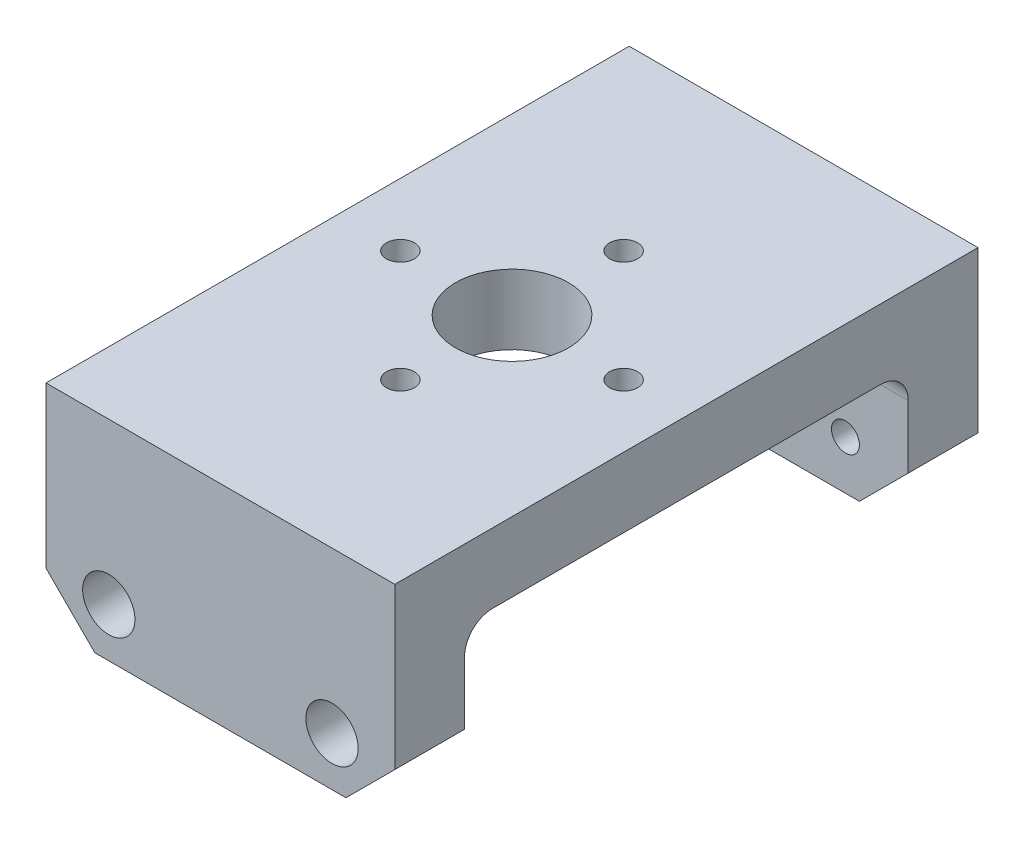
ISO-10303-21;
HEADER;
FILE_DESCRIPTION(('STEP AP214'),'2;1');
FILE_NAME('part.step','',(''),(''),'','','');
FILE_SCHEMA(('AUTOMOTIVE_DESIGN { 1 0 10303 214 1 1 1 1 }'));
ENDSEC;
DATA;
#1=APPLICATION_CONTEXT('core data for automotive mechanical design processes');
#2=APPLICATION_PROTOCOL_DEFINITION('international standard','automotive_design',2000,#1);
#3=PRODUCT_CONTEXT('',#1,'mechanical');
#4=PRODUCT('Part','Part','',(#3));
#5=PRODUCT_RELATED_PRODUCT_CATEGORY('part','',(#4));
#6=PRODUCT_DEFINITION_FORMATION('','',#4);
#7=PRODUCT_DEFINITION_CONTEXT('part definition',#1,'design');
#8=PRODUCT_DEFINITION('design','',#6,#7);
#9=PRODUCT_DEFINITION_SHAPE('','',#8);
#10=(LENGTH_UNIT() NAMED_UNIT(*) SI_UNIT(.MILLI.,.METRE.));
#11=(NAMED_UNIT(*) PLANE_ANGLE_UNIT() SI_UNIT($,.RADIAN.));
#12=(NAMED_UNIT(*) SI_UNIT($,.STERADIAN.) SOLID_ANGLE_UNIT());
#13=UNCERTAINTY_MEASURE_WITH_UNIT(LENGTH_MEASURE(1.E-05),#10,'distance_accuracy_value','');
#14=(GEOMETRIC_REPRESENTATION_CONTEXT(3) GLOBAL_UNCERTAINTY_ASSIGNED_CONTEXT((#13)) GLOBAL_UNIT_ASSIGNED_CONTEXT((#10,
#11,#12)) REPRESENTATION_CONTEXT('',''));
#15=CARTESIAN_POINT('',(0.,0.,0.));
#16=DIRECTION('',(0.,0.,1.));
#17=DIRECTION('',(1.,0.,0.));
#18=AXIS2_PLACEMENT_3D('',#15,#16,#17);
#19=CARTESIAN_POINT('',(12.5000000000024,15.,28.9));
#20=DIRECTION('',(0.,-1.,0.));
#21=DIRECTION('',(0.,0.,-1.));
#22=AXIS2_PLACEMENT_3D('',#19,#20,#21);
#23=CYLINDRICAL_SURFACE('',#22,1.);
#24=CARTESIAN_POINT('',(12.5000000000024,15.,28.9));
#25=DIRECTION('',(0.,-1.,0.));
#26=DIRECTION('',(1.,0.,0.));
#27=AXIS2_PLACEMENT_3D('',#24,#25,#26);
#28=CIRCLE('',#27,1.);
#29=CARTESIAN_POINT('',(13.5000000000024,15.,28.9));
#30=VERTEX_POINT('',#29);
#31=EDGE_CURVE('E762',#30,#30,#28,.T.);
#32=ORIENTED_EDGE('',*,*,#31,.F.);
#33=EDGE_LOOP('',(#32));
#34=FACE_BOUND('',#33,.T.);
#35=CARTESIAN_POINT('',(12.5000000000024,11.25,28.9));
#36=DIRECTION('',(0.,-1.,0.));
#37=DIRECTION('',(0.,0.,-1.));
#38=AXIS2_PLACEMENT_3D('',#35,#36,#37);
#39=CIRCLE('',#38,1.);
#40=CARTESIAN_POINT('',(12.5000000000024,11.25,27.9));
#41=VERTEX_POINT('',#40);
#42=EDGE_CURVE('E745',#41,#41,#39,.F.);
#43=ORIENTED_EDGE('',*,*,#42,.F.);
#44=EDGE_LOOP('',(#43));
#45=FACE_BOUND('',#44,.T.);
#46=ADVANCED_FACE('F34',(#34,#45),#23,.F.);
#47=CARTESIAN_POINT('',(4.5,15.,20.9000000000023));
#48=DIRECTION('',(0.,-1.,0.));
#49=DIRECTION('',(0.,0.,-1.));
#50=AXIS2_PLACEMENT_3D('',#47,#48,#49);
#51=CYLINDRICAL_SURFACE('',#50,1.);
#52=CARTESIAN_POINT('',(4.5,15.,20.9000000000023));
#53=DIRECTION('',(0.,-1.,0.));
#54=DIRECTION('',(0.,0.,1.));
#55=AXIS2_PLACEMENT_3D('',#52,#53,#54);
#56=CIRCLE('',#55,1.);
#57=CARTESIAN_POINT('',(4.5,15.,21.9000000000023));
#58=VERTEX_POINT('',#57);
#59=EDGE_CURVE('E765',#58,#58,#56,.T.);
#60=ORIENTED_EDGE('',*,*,#59,.F.);
#61=EDGE_LOOP('',(#60));
#62=FACE_BOUND('',#61,.T.);
#63=CARTESIAN_POINT('',(4.5,11.25,20.9000000000023));
#64=DIRECTION('',(0.,-1.,0.));
#65=DIRECTION('',(0.,0.,-1.));
#66=AXIS2_PLACEMENT_3D('',#63,#64,#65);
#67=CIRCLE('',#66,1.);
#68=CARTESIAN_POINT('',(4.5,11.25,19.9000000000023));
#69=VERTEX_POINT('',#68);
#70=EDGE_CURVE('E751',#69,#69,#67,.F.);
#71=ORIENTED_EDGE('',*,*,#70,.F.);
#72=EDGE_LOOP('',(#71));
#73=FACE_BOUND('',#72,.T.);
#74=ADVANCED_FACE('F333',(#62,#73),#51,.F.);
#75=CARTESIAN_POINT('',(12.4999999999977,15.,12.9));
#76=DIRECTION('',(0.,-1.,0.));
#77=DIRECTION('',(0.,0.,-1.));
#78=AXIS2_PLACEMENT_3D('',#75,#76,#77);
#79=CYLINDRICAL_SURFACE('',#78,1.);
#80=CARTESIAN_POINT('',(12.4999999999977,15.,12.9));
#81=DIRECTION('',(0.,-1.,0.));
#82=DIRECTION('',(-1.,0.,0.));
#83=AXIS2_PLACEMENT_3D('',#80,#81,#82);
#84=CIRCLE('',#83,1.);
#85=CARTESIAN_POINT('',(11.4999999999977,15.,12.9));
#86=VERTEX_POINT('',#85);
#87=EDGE_CURVE('E768',#86,#86,#84,.T.);
#88=ORIENTED_EDGE('',*,*,#87,.F.);
#89=EDGE_LOOP('',(#88));
#90=FACE_BOUND('',#89,.T.);
#91=CARTESIAN_POINT('',(12.4999999999977,11.25,12.9));
#92=DIRECTION('',(0.,-1.,0.));
#93=DIRECTION('',(0.,0.,-1.));
#94=AXIS2_PLACEMENT_3D('',#91,#92,#93);
#95=CIRCLE('',#94,1.);
#96=CARTESIAN_POINT('',(12.4999999999977,11.25,11.9));
#97=VERTEX_POINT('',#96);
#98=EDGE_CURVE('E758',#97,#97,#95,.F.);
#99=ORIENTED_EDGE('',*,*,#98,.F.);
#100=EDGE_LOOP('',(#99));
#101=FACE_BOUND('',#100,.T.);
#102=ADVANCED_FACE('F339',(#90,#101),#79,.F.);
#103=CARTESIAN_POINT('',(20.5,15.,20.8999999999977));
#104=DIRECTION('',(0.,-1.,0.));
#105=DIRECTION('',(0.,0.,-1.));
#106=AXIS2_PLACEMENT_3D('',#103,#104,#105);
#107=CYLINDRICAL_SURFACE('',#106,1.);
#108=CARTESIAN_POINT('',(20.5,15.,20.8999999999977));
#109=DIRECTION('',(0.,-1.,0.));
#110=DIRECTION('',(0.,0.,-1.));
#111=AXIS2_PLACEMENT_3D('',#108,#109,#110);
#112=CIRCLE('',#111,1.);
#113=CARTESIAN_POINT('',(20.5,15.,19.8999999999977));
#114=VERTEX_POINT('',#113);
#115=EDGE_CURVE('E778',#114,#114,#112,.T.);
#116=ORIENTED_EDGE('',*,*,#115,.F.);
#117=EDGE_LOOP('',(#116));
#118=FACE_BOUND('',#117,.T.);
#119=CARTESIAN_POINT('',(20.5,11.25,20.8999999999977));
#120=DIRECTION('',(0.,-1.,0.));
#121=DIRECTION('',(0.,0.,-1.));
#122=AXIS2_PLACEMENT_3D('',#119,#120,#121);
#123=CIRCLE('',#122,1.);
#124=CARTESIAN_POINT('',(20.5,11.25,19.8999999999977));
#125=VERTEX_POINT('',#124);
#126=EDGE_CURVE('E775',#125,#125,#123,.F.);
#127=ORIENTED_EDGE('',*,*,#126,.F.);
#128=EDGE_LOOP('',(#127));
#129=FACE_BOUND('',#128,.T.);
#130=ADVANCED_FACE('F350',(#118,#129),#107,.F.);
#131=CARTESIAN_POINT('',(4.5,3.5,5.));
#132=DIRECTION('',(0.,0.,-1.));
#133=DIRECTION('',(-1.,0.,0.));
#134=AXIS2_PLACEMENT_3D('',#131,#132,#133);
#135=CYLINDRICAL_SURFACE('',#134,1.);
#136=CARTESIAN_POINT('',(4.5,3.5,5.));
#137=DIRECTION('',(0.,0.,1.));
#138=DIRECTION('',(1.,0.,0.));
#139=AXIS2_PLACEMENT_3D('',#136,#137,#138);
#140=CIRCLE('',#139,1.);
#141=CARTESIAN_POINT('',(5.5,3.5,5.));
#142=VERTEX_POINT('',#141);
#143=EDGE_CURVE('E229',#142,#142,#140,.T.);
#144=ORIENTED_EDGE('',*,*,#143,.T.);
#145=EDGE_LOOP('',(#144));
#146=FACE_BOUND('',#145,.T.);
#147=CARTESIAN_POINT('',(4.5,3.5,3.3));
#148=DIRECTION('',(0.,0.,-1.));
#149=DIRECTION('',(-1.,0.,0.));
#150=AXIS2_PLACEMENT_3D('',#147,#148,#149);
#151=CIRCLE('',#150,1.);
#152=CARTESIAN_POINT('',(3.5,3.5,3.3));
#153=VERTEX_POINT('',#152);
#154=EDGE_CURVE('E243',#153,#153,#151,.T.);
#155=ORIENTED_EDGE('',*,*,#154,.T.);
#156=EDGE_LOOP('',(#155));
#157=FACE_BOUND('',#156,.T.);
#158=ADVANCED_FACE('F363',(#146,#157),#135,.F.);
#159=CARTESIAN_POINT('',(20.5,3.5,5.));
#160=DIRECTION('',(0.,0.,-1.));
#161=DIRECTION('',(-1.,0.,0.));
#162=AXIS2_PLACEMENT_3D('',#159,#160,#161);
#163=CYLINDRICAL_SURFACE('',#162,1.);
#164=CARTESIAN_POINT('',(20.5,3.5,5.));
#165=DIRECTION('',(0.,0.,1.));
#166=DIRECTION('',(1.,0.,0.));
#167=AXIS2_PLACEMENT_3D('',#164,#165,#166);
#168=CIRCLE('',#167,1.);
#169=CARTESIAN_POINT('',(21.5,3.5,5.));
#170=VERTEX_POINT('',#169);
#171=EDGE_CURVE('E289',#170,#170,#168,.T.);
#172=ORIENTED_EDGE('',*,*,#171,.T.);
#173=EDGE_LOOP('',(#172));
#174=FACE_BOUND('',#173,.T.);
#175=CARTESIAN_POINT('',(20.5,3.5,3.3));
#176=DIRECTION('',(0.,0.,-1.));
#177=DIRECTION('',(-1.,0.,0.));
#178=AXIS2_PLACEMENT_3D('',#175,#176,#177);
#179=CIRCLE('',#178,1.);
#180=CARTESIAN_POINT('',(19.5,3.5,3.3));
#181=VERTEX_POINT('',#180);
#182=EDGE_CURVE('E286',#181,#181,#179,.T.);
#183=ORIENTED_EDGE('',*,*,#182,.T.);
#184=EDGE_LOOP('',(#183));
#185=FACE_BOUND('',#184,.T.);
#186=ADVANCED_FACE('F429',(#174,#185),#163,.F.);
#187=CARTESIAN_POINT('',(0.,0.,5.));
#188=DIRECTION('',(0.,0.,-1.));
#189=DIRECTION('',(-1.,0.,0.));
#190=AXIS2_PLACEMENT_3D('',#187,#188,#189);
#191=PLANE('',#190);
#192=ORIENTED_EDGE('',*,*,#143,.F.);
#193=EDGE_LOOP('',(#192));
#194=FACE_BOUND('',#193,.T.);
#195=DIRECTION('',(0.,1.,0.));
#196=VECTOR('',#195,1.);
#197=CARTESIAN_POINT('',(25.,0.,5.));
#198=LINE('',#197,#196);
#199=CARTESIAN_POINT('',(25.,3.5,5.));
#200=VERTEX_POINT('',#199);
#201=CARTESIAN_POINT('',(25.,7.99999999999999,5.));
#202=VERTEX_POINT('',#201);
#203=EDGE_CURVE('E233',#200,#202,#198,.T.);
#204=ORIENTED_EDGE('',*,*,#203,.T.);
#205=DIRECTION('',(-1.,0.,0.));
#206=VECTOR('',#205,1.);
#207=CARTESIAN_POINT('',(0.,8.,5.));
#208=LINE('',#207,#206);
#209=CARTESIAN_POINT('',(0.,7.99999999999999,5.));
#210=VERTEX_POINT('',#209);
#211=EDGE_CURVE('E219',#202,#210,#208,.T.);
#212=ORIENTED_EDGE('',*,*,#211,.T.);
#213=DIRECTION('',(0.,-1.,0.));
#214=VECTOR('',#213,1.);
#215=CARTESIAN_POINT('',(0.,0.,5.));
#216=LINE('',#215,#214);
#217=CARTESIAN_POINT('',(0.,3.5,5.));
#218=VERTEX_POINT('',#217);
#219=EDGE_CURVE('E220',#210,#218,#216,.T.);
#220=ORIENTED_EDGE('',*,*,#219,.T.);
#221=DIRECTION('',(0.707106781186547,-0.707106781186547,0.));
#222=VECTOR('',#221,1.);
#223=CARTESIAN_POINT('',(3.5,0.,5.));
#224=LINE('',#223,#222);
#225=CARTESIAN_POINT('',(3.5,0.,5.));
#226=VERTEX_POINT('',#225);
#227=EDGE_CURVE('E269',#218,#226,#224,.T.);
#228=ORIENTED_EDGE('',*,*,#227,.T.);
#229=DIRECTION('',(1.,0.,0.));
#230=VECTOR('',#229,1.);
#231=CARTESIAN_POINT('',(0.,0.,5.));
#232=LINE('',#231,#230);
#233=CARTESIAN_POINT('',(21.5,0.,5.));
#234=VERTEX_POINT('',#233);
#235=EDGE_CURVE('E223',#226,#234,#232,.T.);
#236=ORIENTED_EDGE('',*,*,#235,.T.);
#237=DIRECTION('',(0.707106781186547,0.707106781186548,0.));
#238=VECTOR('',#237,1.);
#239=CARTESIAN_POINT('',(25.,3.5,5.));
#240=LINE('',#239,#238);
#241=EDGE_CURVE('E173',#234,#200,#240,.T.);
#242=ORIENTED_EDGE('',*,*,#241,.T.);
#243=EDGE_LOOP('',(#204,#212,#220,#228,#236,#242));
#244=FACE_BOUND('',#243,.T.);
#245=ORIENTED_EDGE('',*,*,#171,.F.);
#246=EDGE_LOOP('',(#245));
#247=FACE_BOUND('',#246,.T.);
#248=ADVANCED_FACE('F253',(#194,#244,#247),#191,.F.);
#249=CARTESIAN_POINT('',(0.,0.,0.));
#250=DIRECTION('',(0.,0.,-1.));
#251=DIRECTION('',(-1.,0.,0.));
#252=AXIS2_PLACEMENT_3D('',#249,#250,#251);
#253=PLANE('',#252);
#254=DIRECTION('',(0.707106781186547,0.707106781186548,0.));
#255=VECTOR('',#254,1.);
#256=CARTESIAN_POINT('',(25.,3.5,0.));
#257=LINE('',#256,#255);
#258=CARTESIAN_POINT('',(21.5,0.,0.));
#259=VERTEX_POINT('',#258);
#260=CARTESIAN_POINT('',(25.,3.5,0.));
#261=VERTEX_POINT('',#260);
#262=EDGE_CURVE('E317',#259,#261,#257,.T.);
#263=ORIENTED_EDGE('',*,*,#262,.F.);
#264=DIRECTION('',(1.,0.,0.));
#265=VECTOR('',#264,1.);
#266=CARTESIAN_POINT('',(0.,0.,0.));
#267=LINE('',#266,#265);
#268=CARTESIAN_POINT('',(3.5,0.,0.));
#269=VERTEX_POINT('',#268);
#270=EDGE_CURVE('E304',#269,#259,#267,.T.);
#271=ORIENTED_EDGE('',*,*,#270,.F.);
#272=DIRECTION('',(0.707106781186547,-0.707106781186547,0.));
#273=VECTOR('',#272,1.);
#274=CARTESIAN_POINT('',(3.5,0.,0.));
#275=LINE('',#274,#273);
#276=CARTESIAN_POINT('',(0.,3.5,0.));
#277=VERTEX_POINT('',#276);
#278=EDGE_CURVE('E274',#277,#269,#275,.T.);
#279=ORIENTED_EDGE('',*,*,#278,.F.);
#280=DIRECTION('',(0.,-1.,0.));
#281=VECTOR('',#280,1.);
#282=CARTESIAN_POINT('',(0.,0.,0.));
#283=LINE('',#282,#281);
#284=CARTESIAN_POINT('',(0.,15.,0.));
#285=VERTEX_POINT('',#284);
#286=EDGE_CURVE('E236',#285,#277,#283,.T.);
#287=ORIENTED_EDGE('',*,*,#286,.F.);
#288=DIRECTION('',(-1.,0.,0.));
#289=VECTOR('',#288,1.);
#290=CARTESIAN_POINT('',(0.,15.,0.));
#291=LINE('',#290,#289);
#292=CARTESIAN_POINT('',(25.,15.,0.));
#293=VERTEX_POINT('',#292);
#294=EDGE_CURVE('E224',#293,#285,#291,.T.);
#295=ORIENTED_EDGE('',*,*,#294,.F.);
#296=DIRECTION('',(0.,1.,0.));
#297=VECTOR('',#296,1.);
#298=CARTESIAN_POINT('',(25.,0.,0.));
#299=LINE('',#298,#297);
#300=EDGE_CURVE('E303',#261,#293,#299,.T.);
#301=ORIENTED_EDGE('',*,*,#300,.F.);
#302=EDGE_LOOP('',(#263,#271,#279,#287,#295,#301));
#303=FACE_BOUND('',#302,.T.);
#304=CARTESIAN_POINT('',(4.5,3.5,0.));
#305=DIRECTION('',(0.,0.,-1.));
#306=DIRECTION('',(-1.,0.,0.));
#307=AXIS2_PLACEMENT_3D('',#304,#305,#306);
#308=CIRCLE('',#307,1.875);
#309=CARTESIAN_POINT('',(2.625,3.5,0.));
#310=VERTEX_POINT('',#309);
#311=EDGE_CURVE('E272',#310,#310,#308,.T.);
#312=ORIENTED_EDGE('',*,*,#311,.F.);
#313=EDGE_LOOP('',(#312));
#314=FACE_BOUND('',#313,.T.);
#315=CARTESIAN_POINT('',(20.5,3.5,0.));
#316=DIRECTION('',(0.,0.,-1.));
#317=DIRECTION('',(-1.,0.,0.));
#318=AXIS2_PLACEMENT_3D('',#315,#316,#317);
#319=CIRCLE('',#318,1.875);
#320=CARTESIAN_POINT('',(18.625,3.5,0.));
#321=VERTEX_POINT('',#320);
#322=EDGE_CURVE('E287',#321,#321,#319,.T.);
#323=ORIENTED_EDGE('',*,*,#322,.F.);
#324=EDGE_LOOP('',(#323));
#325=FACE_BOUND('',#324,.T.);
#326=ADVANCED_FACE('F314',(#303,#314,#325),#253,.T.);
#327=CARTESIAN_POINT('',(0.,0.,5.));
#328=DIRECTION('',(1.,0.,0.));
#329=DIRECTION('',(0.,0.,-1.));
#330=AXIS2_PLACEMENT_3D('',#327,#328,#329);
#331=PLANE('',#330);
#332=ORIENTED_EDGE('',*,*,#286,.T.);
#333=DIRECTION('',(0.,0.,-1.));
#334=VECTOR('',#333,1.);
#335=CARTESIAN_POINT('',(0.,3.5,5.));
#336=LINE('',#335,#334);
#337=EDGE_CURVE('E263',#218,#277,#336,.T.);
#338=ORIENTED_EDGE('',*,*,#337,.F.);
#339=ORIENTED_EDGE('',*,*,#219,.F.);
#340=CARTESIAN_POINT('',(0.,8.,7.));
#341=DIRECTION('',(1.,0.,0.));
#342=DIRECTION('',(0.,0.,-1.));
#343=AXIS2_PLACEMENT_3D('',#340,#341,#342);
#344=CIRCLE('',#343,2.);
#345=CARTESIAN_POINT('',(0.,10.,7.000000000005));
#346=VERTEX_POINT('',#345);
#347=EDGE_CURVE('E42',#210,#346,#344,.T.);
#348=ORIENTED_EDGE('',*,*,#347,.T.);
#349=DIRECTION('',(0.,0.,1.));
#350=VECTOR('',#349,1.);
#351=CARTESIAN_POINT('',(0.,10.,-500000.));
#352=LINE('',#351,#350);
#353=CARTESIAN_POINT('',(0.,10.,34.8000000000184));
#354=VERTEX_POINT('',#353);
#355=EDGE_CURVE('E161',#346,#354,#352,.T.);
#356=ORIENTED_EDGE('',*,*,#355,.T.);
#357=CARTESIAN_POINT('',(0.,8.,34.8000000000184));
#358=DIRECTION('',(1.,0.,0.));
#359=DIRECTION('',(0.,0.,-1.));
#360=AXIS2_PLACEMENT_3D('',#357,#358,#359);
#361=CIRCLE('',#360,2.);
#362=CARTESIAN_POINT('',(0.,7.99999999999999,36.8));
#363=VERTEX_POINT('',#362);
#364=EDGE_CURVE('E215',#354,#363,#361,.T.);
#365=ORIENTED_EDGE('',*,*,#364,.T.);
#366=DIRECTION('',(0.,-1.,0.));
#367=VECTOR('',#366,1.);
#368=CARTESIAN_POINT('',(0.,0.,36.8));
#369=LINE('',#368,#367);
#370=CARTESIAN_POINT('',(0.,3.5,36.8));
#371=VERTEX_POINT('',#370);
#372=EDGE_CURVE('E166',#363,#371,#369,.T.);
#373=ORIENTED_EDGE('',*,*,#372,.T.);
#374=DIRECTION('',(0.,0.,1.));
#375=VECTOR('',#374,1.);
#376=CARTESIAN_POINT('',(0.,3.5,36.8));
#377=LINE('',#376,#375);
#378=CARTESIAN_POINT('',(0.,3.5,41.8));
#379=VERTEX_POINT('',#378);
#380=EDGE_CURVE('E787',#371,#379,#377,.T.);
#381=ORIENTED_EDGE('',*,*,#380,.T.);
#382=DIRECTION('',(0.,-1.,0.));
#383=VECTOR('',#382,1.);
#384=CARTESIAN_POINT('',(0.,0.,41.8));
#385=LINE('',#384,#383);
#386=CARTESIAN_POINT('',(0.,15.,41.8));
#387=VERTEX_POINT('',#386);
#388=EDGE_CURVE('E178',#387,#379,#385,.T.);
#389=ORIENTED_EDGE('',*,*,#388,.F.);
#390=DIRECTION('',(0.,0.,-1.));
#391=VECTOR('',#390,1.);
#392=CARTESIAN_POINT('',(0.,15.,5.));
#393=LINE('',#392,#391);
#394=EDGE_CURVE('E242',#387,#285,#393,.T.);
#395=ORIENTED_EDGE('',*,*,#394,.T.);
#396=EDGE_LOOP('',(#332,#338,#339,#348,#356,#365,#373,#381,#389,#395));
#397=FACE_BOUND('',#396,.T.);
#398=ADVANCED_FACE('F262',(#397),#331,.F.);
#399=CARTESIAN_POINT('',(0.,0.,5.));
#400=DIRECTION('',(0.,1.,0.));
#401=DIRECTION('',(0.,0.,1.));
#402=AXIS2_PLACEMENT_3D('',#399,#400,#401);
#403=PLANE('',#402);
#404=ORIENTED_EDGE('',*,*,#270,.T.);
#405=DIRECTION('',(0.,0.,-1.));
#406=VECTOR('',#405,1.);
#407=CARTESIAN_POINT('',(21.5,0.,5.));
#408=LINE('',#407,#406);
#409=EDGE_CURVE('E311',#234,#259,#408,.T.);
#410=ORIENTED_EDGE('',*,*,#409,.F.);
#411=ORIENTED_EDGE('',*,*,#235,.F.);
#412=DIRECTION('',(0.,0.,-1.));
#413=VECTOR('',#412,1.);
#414=CARTESIAN_POINT('',(3.5,0.,5.));
#415=LINE('',#414,#413);
#416=EDGE_CURVE('E268',#226,#269,#415,.T.);
#417=ORIENTED_EDGE('',*,*,#416,.T.);
#418=EDGE_LOOP('',(#404,#410,#411,#417));
#419=FACE_BOUND('',#418,.T.);
#420=ADVANCED_FACE('F309',(#419),#403,.F.);
#421=CARTESIAN_POINT('',(25.,0.,5.));
#422=DIRECTION('',(-1.,0.,0.));
#423=DIRECTION('',(0.,0.,1.));
#424=AXIS2_PLACEMENT_3D('',#421,#422,#423);
#425=PLANE('',#424);
#426=ORIENTED_EDGE('',*,*,#203,.F.);
#427=DIRECTION('',(0.,0.,-1.));
#428=VECTOR('',#427,1.);
#429=CARTESIAN_POINT('',(25.,3.5,5.));
#430=LINE('',#429,#428);
#431=EDGE_CURVE('E321',#200,#261,#430,.T.);
#432=ORIENTED_EDGE('',*,*,#431,.T.);
#433=ORIENTED_EDGE('',*,*,#300,.T.);
#434=DIRECTION('',(0.,0.,-1.));
#435=VECTOR('',#434,1.);
#436=CARTESIAN_POINT('',(25.,15.,5.));
#437=LINE('',#436,#435);
#438=CARTESIAN_POINT('',(25.,15.,41.8));
#439=VERTEX_POINT('',#438);
#440=EDGE_CURVE('E298',#439,#293,#437,.T.);
#441=ORIENTED_EDGE('',*,*,#440,.F.);
#442=DIRECTION('',(0.,1.,0.));
#443=VECTOR('',#442,1.);
#444=CARTESIAN_POINT('',(25.,0.,41.8));
#445=LINE('',#444,#443);
#446=CARTESIAN_POINT('',(25.,3.5,41.8));
#447=VERTEX_POINT('',#446);
#448=EDGE_CURVE('E142',#447,#439,#445,.T.);
#449=ORIENTED_EDGE('',*,*,#448,.F.);
#450=DIRECTION('',(0.,0.,1.));
#451=VECTOR('',#450,1.);
#452=CARTESIAN_POINT('',(25.,3.5,36.8));
#453=LINE('',#452,#451);
#454=CARTESIAN_POINT('',(25.,3.5,36.8));
#455=VERTEX_POINT('',#454);
#456=EDGE_CURVE('E133',#455,#447,#453,.T.);
#457=ORIENTED_EDGE('',*,*,#456,.F.);
#458=DIRECTION('',(0.,1.,0.));
#459=VECTOR('',#458,1.);
#460=CARTESIAN_POINT('',(25.,0.,36.8));
#461=LINE('',#460,#459);
#462=CARTESIAN_POINT('',(25.,7.99999999999999,36.8));
#463=VERTEX_POINT('',#462);
#464=EDGE_CURVE('E139',#455,#463,#461,.T.);
#465=ORIENTED_EDGE('',*,*,#464,.T.);
#466=CARTESIAN_POINT('',(25.,8.,34.8000000000184));
#467=DIRECTION('',(-1.,0.,0.));
#468=DIRECTION('',(0.,0.,1.));
#469=AXIS2_PLACEMENT_3D('',#466,#467,#468);
#470=CIRCLE('',#469,2.);
#471=CARTESIAN_POINT('',(25.,10.,34.8000000000184));
#472=VERTEX_POINT('',#471);
#473=EDGE_CURVE('E217',#463,#472,#470,.T.);
#474=ORIENTED_EDGE('',*,*,#473,.T.);
#475=DIRECTION('',(0.,0.,1.));
#476=VECTOR('',#475,1.);
#477=CARTESIAN_POINT('',(25.,10.,-500000.));
#478=LINE('',#477,#476);
#479=CARTESIAN_POINT('',(25.,10.,7.000000000005));
#480=VERTEX_POINT('',#479);
#481=EDGE_CURVE('E164',#480,#472,#478,.T.);
#482=ORIENTED_EDGE('',*,*,#481,.F.);
#483=CARTESIAN_POINT('',(25.,8.,7.));
#484=DIRECTION('',(-1.,0.,0.));
#485=DIRECTION('',(0.,0.,1.));
#486=AXIS2_PLACEMENT_3D('',#483,#484,#485);
#487=CIRCLE('',#486,2.);
#488=EDGE_CURVE('E11',#480,#202,#487,.T.);
#489=ORIENTED_EDGE('',*,*,#488,.T.);
#490=EDGE_LOOP('',(#426,#432,#433,#441,#449,#457,#465,#474,#482,#489));
#491=FACE_BOUND('',#490,.T.);
#492=ADVANCED_FACE('F136',(#491),#425,.F.);
#493=CARTESIAN_POINT('',(0.,15.,5.));
#494=DIRECTION('',(0.,-1.,0.));
#495=DIRECTION('',(0.,0.,-1.));
#496=AXIS2_PLACEMENT_3D('',#493,#494,#495);
#497=PLANE('',#496);
#498=CARTESIAN_POINT('',(12.5,15.,20.9));
#499=DIRECTION('',(0.,-1.,0.));
#500=DIRECTION('',(0.,0.,-1.));
#501=AXIS2_PLACEMENT_3D('',#498,#499,#500);
#502=CIRCLE('',#501,4.05);
#503=CARTESIAN_POINT('',(12.5,15.,16.85));
#504=VERTEX_POINT('',#503);
#505=EDGE_CURVE('E734',#504,#504,#502,.T.);
#506=ORIENTED_EDGE('',*,*,#505,.T.);
#507=EDGE_LOOP('',(#506));
#508=FACE_BOUND('',#507,.T.);
#509=ORIENTED_EDGE('',*,*,#31,.T.);
#510=EDGE_LOOP('',(#509));
#511=FACE_BOUND('',#510,.T.);
#512=ORIENTED_EDGE('',*,*,#59,.T.);
#513=EDGE_LOOP('',(#512));
#514=FACE_BOUND('',#513,.T.);
#515=ORIENTED_EDGE('',*,*,#87,.T.);
#516=EDGE_LOOP('',(#515));
#517=FACE_BOUND('',#516,.T.);
#518=ORIENTED_EDGE('',*,*,#115,.T.);
#519=EDGE_LOOP('',(#518));
#520=FACE_BOUND('',#519,.T.);
#521=ORIENTED_EDGE('',*,*,#294,.T.);
#522=ORIENTED_EDGE('',*,*,#394,.F.);
#523=DIRECTION('',(-1.,0.,0.));
#524=VECTOR('',#523,1.);
#525=CARTESIAN_POINT('',(0.,15.,41.8));
#526=LINE('',#525,#524);
#527=EDGE_CURVE('E186',#439,#387,#526,.T.);
#528=ORIENTED_EDGE('',*,*,#527,.F.);
#529=ORIENTED_EDGE('',*,*,#440,.T.);
#530=EDGE_LOOP('',(#521,#522,#528,#529));
#531=FACE_BOUND('',#530,.T.);
#532=ADVANCED_FACE('F427',(#508,#511,#514,#517,#520,#531),#497,.F.);
#533=CARTESIAN_POINT('',(20.5,3.5,3.3));
#534=DIRECTION('',(0.,0.,-1.));
#535=DIRECTION('',(-1.,0.,0.));
#536=AXIS2_PLACEMENT_3D('',#533,#534,#535);
#537=CYLINDRICAL_SURFACE('',#536,1.875);
#538=CARTESIAN_POINT('',(20.5,3.5,3.3));
#539=DIRECTION('',(0.,0.,-1.));
#540=DIRECTION('',(-1.,0.,0.));
#541=AXIS2_PLACEMENT_3D('',#538,#539,#540);
#542=CIRCLE('',#541,1.875);
#543=CARTESIAN_POINT('',(18.625,3.5,3.3));
#544=VERTEX_POINT('',#543);
#545=EDGE_CURVE('E283',#544,#544,#542,.T.);
#546=ORIENTED_EDGE('',*,*,#545,.F.);
#547=EDGE_LOOP('',(#546));
#548=FACE_BOUND('',#547,.T.);
#549=ORIENTED_EDGE('',*,*,#322,.T.);
#550=EDGE_LOOP('',(#549));
#551=FACE_BOUND('',#550,.T.);
#552=ADVANCED_FACE('F423',(#548,#551),#537,.F.);
#553=CARTESIAN_POINT('',(20.5,3.5,3.3));
#554=DIRECTION('',(0.,0.,-1.));
#555=DIRECTION('',(-1.,0.,0.));
#556=AXIS2_PLACEMENT_3D('',#553,#554,#555);
#557=PLANE('',#556);
#558=ORIENTED_EDGE('',*,*,#182,.F.);
#559=EDGE_LOOP('',(#558));
#560=FACE_BOUND('',#559,.T.);
#561=ORIENTED_EDGE('',*,*,#545,.T.);
#562=EDGE_LOOP('',(#561));
#563=FACE_BOUND('',#562,.T.);
#564=ADVANCED_FACE('F419',(#560,#563),#557,.T.);
#565=CARTESIAN_POINT('',(4.5,3.5,3.3));
#566=DIRECTION('',(0.,0.,-1.));
#567=DIRECTION('',(-1.,0.,0.));
#568=AXIS2_PLACEMENT_3D('',#565,#566,#567);
#569=CYLINDRICAL_SURFACE('',#568,1.875);
#570=CARTESIAN_POINT('',(4.5,3.5,3.3));
#571=DIRECTION('',(0.,0.,-1.));
#572=DIRECTION('',(-1.,0.,0.));
#573=AXIS2_PLACEMENT_3D('',#570,#571,#572);
#574=CIRCLE('',#573,1.875);
#575=CARTESIAN_POINT('',(2.625,3.5,3.3));
#576=VERTEX_POINT('',#575);
#577=EDGE_CURVE('E278',#576,#576,#574,.T.);
#578=ORIENTED_EDGE('',*,*,#577,.F.);
#579=EDGE_LOOP('',(#578));
#580=FACE_BOUND('',#579,.T.);
#581=ORIENTED_EDGE('',*,*,#311,.T.);
#582=EDGE_LOOP('',(#581));
#583=FACE_BOUND('',#582,.T.);
#584=ADVANCED_FACE('F415',(#580,#583),#569,.F.);
#585=CARTESIAN_POINT('',(4.5,3.5,3.3));
#586=DIRECTION('',(0.,0.,-1.));
#587=DIRECTION('',(-1.,0.,0.));
#588=AXIS2_PLACEMENT_3D('',#585,#586,#587);
#589=PLANE('',#588);
#590=ORIENTED_EDGE('',*,*,#154,.F.);
#591=EDGE_LOOP('',(#590));
#592=FACE_BOUND('',#591,.T.);
#593=ORIENTED_EDGE('',*,*,#577,.T.);
#594=EDGE_LOOP('',(#593));
#595=FACE_BOUND('',#594,.T.);
#596=ADVANCED_FACE('F412',(#592,#595),#589,.T.);
#597=CARTESIAN_POINT('',(3.5,0.,5.));
#598=DIRECTION('',(0.707106781186548,0.707106781186548,0.));
#599=DIRECTION('',(-0.707106781186548,0.707106781186548,0.));
#600=AXIS2_PLACEMENT_3D('',#597,#598,#599);
#601=PLANE('',#600);
#602=ORIENTED_EDGE('',*,*,#278,.T.);
#603=ORIENTED_EDGE('',*,*,#416,.F.);
#604=ORIENTED_EDGE('',*,*,#227,.F.);
#605=ORIENTED_EDGE('',*,*,#337,.T.);
#606=EDGE_LOOP('',(#602,#603,#604,#605));
#607=FACE_BOUND('',#606,.T.);
#608=ADVANCED_FACE('F324',(#607),#601,.F.);
#609=CARTESIAN_POINT('',(25.,3.5,5.));
#610=DIRECTION('',(-0.707106781186548,0.707106781186547,0.));
#611=DIRECTION('',(-0.707106781186547,-0.707106781186548,0.));
#612=AXIS2_PLACEMENT_3D('',#609,#610,#611);
#613=PLANE('',#612);
#614=ORIENTED_EDGE('',*,*,#262,.T.);
#615=ORIENTED_EDGE('',*,*,#431,.F.);
#616=ORIENTED_EDGE('',*,*,#241,.F.);
#617=ORIENTED_EDGE('',*,*,#409,.T.);
#618=EDGE_LOOP('',(#614,#615,#616,#617));
#619=FACE_BOUND('',#618,.T.);
#620=ADVANCED_FACE('F406',(#619),#613,.F.);
#621=CARTESIAN_POINT('',(25.,10.,-500000.));
#622=DIRECTION('',(0.,1.,0.));
#623=DIRECTION('',(0.,0.,1.));
#624=AXIS2_PLACEMENT_3D('',#621,#622,#623);
#625=PLANE('',#624);
#626=CARTESIAN_POINT('',(12.5,10.,20.9));
#627=DIRECTION('',(0.,-1.,0.));
#628=DIRECTION('',(0.,0.,-1.));
#629=AXIS2_PLACEMENT_3D('',#626,#627,#628);
#630=CIRCLE('',#629,4.05);
#631=CARTESIAN_POINT('',(12.5,10.,16.85));
#632=VERTEX_POINT('',#631);
#633=EDGE_CURVE('E737',#632,#632,#630,.T.);
#634=ORIENTED_EDGE('',*,*,#633,.F.);
#635=EDGE_LOOP('',(#634));
#636=FACE_BOUND('',#635,.T.);
#637=CARTESIAN_POINT('',(12.5000000000024,10.,28.9));
#638=DIRECTION('',(0.,-1.,0.));
#639=DIRECTION('',(1.,0.,0.));
#640=AXIS2_PLACEMENT_3D('',#637,#638,#639);
#641=CIRCLE('',#640,1.875);
#642=CARTESIAN_POINT('',(14.3750000000024,10.,28.9));
#643=VERTEX_POINT('',#642);
#644=EDGE_CURVE('E739',#643,#643,#641,.T.);
#645=ORIENTED_EDGE('',*,*,#644,.F.);
#646=EDGE_LOOP('',(#645));
#647=FACE_BOUND('',#646,.T.);
#648=CARTESIAN_POINT('',(4.5,10.,20.9000000000023));
#649=DIRECTION('',(0.,-1.,0.));
#650=DIRECTION('',(0.,0.,1.));
#651=AXIS2_PLACEMENT_3D('',#648,#649,#650);
#652=CIRCLE('',#651,1.875);
#653=CARTESIAN_POINT('',(4.5,10.,22.7750000000023));
#654=VERTEX_POINT('',#653);
#655=EDGE_CURVE('E752',#654,#654,#652,.T.);
#656=ORIENTED_EDGE('',*,*,#655,.F.);
#657=EDGE_LOOP('',(#656));
#658=FACE_BOUND('',#657,.T.);
#659=CARTESIAN_POINT('',(12.4999999999977,10.,12.9));
#660=DIRECTION('',(0.,-1.,0.));
#661=DIRECTION('',(-1.,0.,0.));
#662=AXIS2_PLACEMENT_3D('',#659,#660,#661);
#663=CIRCLE('',#662,1.875);
#664=CARTESIAN_POINT('',(10.6249999999977,10.,12.9));
#665=VERTEX_POINT('',#664);
#666=EDGE_CURVE('E759',#665,#665,#663,.T.);
#667=ORIENTED_EDGE('',*,*,#666,.F.);
#668=EDGE_LOOP('',(#667));
#669=FACE_BOUND('',#668,.T.);
#670=CARTESIAN_POINT('',(20.5,10.,20.8999999999977));
#671=DIRECTION('',(0.,-1.,0.));
#672=DIRECTION('',(0.,0.,-1.));
#673=AXIS2_PLACEMENT_3D('',#670,#671,#672);
#674=CIRCLE('',#673,1.875);
#675=CARTESIAN_POINT('',(20.5,10.,19.0249999999977));
#676=VERTEX_POINT('',#675);
#677=EDGE_CURVE('E771',#676,#676,#674,.T.);
#678=ORIENTED_EDGE('',*,*,#677,.F.);
#679=EDGE_LOOP('',(#678));
#680=FACE_BOUND('',#679,.T.);
#681=ORIENTED_EDGE('',*,*,#355,.F.);
#682=DIRECTION('',(-1.,0.,0.));
#683=VECTOR('',#682,1.);
#684=CARTESIAN_POINT('',(25.,10.,7.));
#685=LINE('',#684,#683);
#686=EDGE_CURVE('E55',#346,#480,#685,.F.);
#687=ORIENTED_EDGE('',*,*,#686,.T.);
#688=ORIENTED_EDGE('',*,*,#481,.T.);
#689=DIRECTION('',(-1.,0.,0.));
#690=VECTOR('',#689,1.);
#691=CARTESIAN_POINT('',(0.,10.,34.8000000000184));
#692=LINE('',#691,#690);
#693=EDGE_CURVE('E212',#472,#354,#692,.T.);
#694=ORIENTED_EDGE('',*,*,#693,.T.);
#695=EDGE_LOOP('',(#681,#687,#688,#694));
#696=FACE_BOUND('',#695,.T.);
#697=ADVANCED_FACE('F393',(#636,#647,#658,#669,#680,#696),#625,.F.);
#698=CARTESIAN_POINT('',(4.5,3.5,36.8));
#699=DIRECTION('',(0.,0.,1.));
#700=DIRECTION('',(-1.,0.,0.));
#701=AXIS2_PLACEMENT_3D('',#698,#699,#700);
#702=CYLINDRICAL_SURFACE('',#701,1.);
#703=CARTESIAN_POINT('',(4.5,3.5,36.8));
#704=DIRECTION('',(0.,0.,1.));
#705=DIRECTION('',(1.,0.,0.));
#706=AXIS2_PLACEMENT_3D('',#703,#704,#705);
#707=CIRCLE('',#706,1.);
#708=CARTESIAN_POINT('',(5.5,3.5,36.8));
#709=VERTEX_POINT('',#708);
#710=EDGE_CURVE('E182',#709,#709,#707,.T.);
#711=ORIENTED_EDGE('',*,*,#710,.F.);
#712=EDGE_LOOP('',(#711));
#713=FACE_BOUND('',#712,.T.);
#714=CARTESIAN_POINT('',(4.5,3.5,38.5));
#715=DIRECTION('',(0.,0.,-1.));
#716=DIRECTION('',(-1.,0.,0.));
#717=AXIS2_PLACEMENT_3D('',#714,#715,#716);
#718=CIRCLE('',#717,1.);
#719=CARTESIAN_POINT('',(3.5,3.5,38.5));
#720=VERTEX_POINT('',#719);
#721=EDGE_CURVE('E171',#720,#720,#718,.T.);
#722=ORIENTED_EDGE('',*,*,#721,.F.);
#723=EDGE_LOOP('',(#722));
#724=FACE_BOUND('',#723,.T.);
#725=ADVANCED_FACE('F389',(#713,#724),#702,.F.);
#726=CARTESIAN_POINT('',(20.5,3.5,36.8));
#727=DIRECTION('',(0.,0.,1.));
#728=DIRECTION('',(-1.,0.,0.));
#729=AXIS2_PLACEMENT_3D('',#726,#727,#728);
#730=CYLINDRICAL_SURFACE('',#729,1.);
#731=CARTESIAN_POINT('',(20.5,3.5,36.8));
#732=DIRECTION('',(0.,0.,1.));
#733=DIRECTION('',(1.,0.,0.));
#734=AXIS2_PLACEMENT_3D('',#731,#732,#733);
#735=CIRCLE('',#734,1.);
#736=CARTESIAN_POINT('',(21.5,3.5,36.8));
#737=VERTEX_POINT('',#736);
#738=EDGE_CURVE('E190',#737,#737,#735,.T.);
#739=ORIENTED_EDGE('',*,*,#738,.F.);
#740=EDGE_LOOP('',(#739));
#741=FACE_BOUND('',#740,.T.);
#742=CARTESIAN_POINT('',(20.5,3.5,38.5));
#743=DIRECTION('',(0.,0.,-1.));
#744=DIRECTION('',(-1.,0.,0.));
#745=AXIS2_PLACEMENT_3D('',#742,#743,#744);
#746=CIRCLE('',#745,1.);
#747=CARTESIAN_POINT('',(19.5,3.5,38.5));
#748=VERTEX_POINT('',#747);
#749=EDGE_CURVE('E188',#748,#748,#746,.T.);
#750=ORIENTED_EDGE('',*,*,#749,.F.);
#751=EDGE_LOOP('',(#750));
#752=FACE_BOUND('',#751,.T.);
#753=ADVANCED_FACE('F386',(#741,#752),#730,.F.);
#754=CARTESIAN_POINT('',(0.,0.,36.8));
#755=DIRECTION('',(0.,0.,1.));
#756=DIRECTION('',(-1.,0.,0.));
#757=AXIS2_PLACEMENT_3D('',#754,#755,#756);
#758=PLANE('',#757);
#759=ORIENTED_EDGE('',*,*,#372,.F.);
#760=DIRECTION('',(-1.,0.,0.));
#761=VECTOR('',#760,1.);
#762=CARTESIAN_POINT('',(25.,8.,36.8));
#763=LINE('',#762,#761);
#764=EDGE_CURVE('E160',#363,#463,#763,.F.);
#765=ORIENTED_EDGE('',*,*,#764,.T.);
#766=ORIENTED_EDGE('',*,*,#464,.F.);
#767=DIRECTION('',(0.707106781186547,0.707106781186548,0.));
#768=VECTOR('',#767,1.);
#769=CARTESIAN_POINT('',(25.,3.5,36.8));
#770=LINE('',#769,#768);
#771=CARTESIAN_POINT('',(21.5,0.,36.8));
#772=VERTEX_POINT('',#771);
#773=EDGE_CURVE('E147',#772,#455,#770,.T.);
#774=ORIENTED_EDGE('',*,*,#773,.F.);
#775=DIRECTION('',(1.,0.,0.));
#776=VECTOR('',#775,1.);
#777=CARTESIAN_POINT('',(0.,0.,36.8));
#778=LINE('',#777,#776);
#779=CARTESIAN_POINT('',(3.5,0.,36.8));
#780=VERTEX_POINT('',#779);
#781=EDGE_CURVE('E162',#780,#772,#778,.T.);
#782=ORIENTED_EDGE('',*,*,#781,.F.);
#783=DIRECTION('',(0.707106781186547,-0.707106781186547,0.));
#784=VECTOR('',#783,1.);
#785=CARTESIAN_POINT('',(3.5,0.,36.8));
#786=LINE('',#785,#784);
#787=EDGE_CURVE('E784',#371,#780,#786,.T.);
#788=ORIENTED_EDGE('',*,*,#787,.F.);
#789=EDGE_LOOP('',(#759,#765,#766,#774,#782,#788));
#790=FACE_BOUND('',#789,.T.);
#791=ORIENTED_EDGE('',*,*,#710,.T.);
#792=EDGE_LOOP('',(#791));
#793=FACE_BOUND('',#792,.T.);
#794=ORIENTED_EDGE('',*,*,#738,.T.);
#795=EDGE_LOOP('',(#794));
#796=FACE_BOUND('',#795,.T.);
#797=ADVANCED_FACE('F157',(#790,#793,#796),#758,.F.);
#798=CARTESIAN_POINT('',(0.,0.,41.8));
#799=DIRECTION('',(0.,0.,1.));
#800=DIRECTION('',(-1.,0.,0.));
#801=AXIS2_PLACEMENT_3D('',#798,#799,#800);
#802=PLANE('',#801);
#803=DIRECTION('',(0.707106781186547,0.707106781186548,0.));
#804=VECTOR('',#803,1.);
#805=CARTESIAN_POINT('',(25.,3.5,41.8));
#806=LINE('',#805,#804);
#807=CARTESIAN_POINT('',(21.5,0.,41.8));
#808=VERTEX_POINT('',#807);
#809=EDGE_CURVE('E154',#808,#447,#806,.T.);
#810=ORIENTED_EDGE('',*,*,#809,.T.);
#811=ORIENTED_EDGE('',*,*,#448,.T.);
#812=ORIENTED_EDGE('',*,*,#527,.T.);
#813=ORIENTED_EDGE('',*,*,#388,.T.);
#814=DIRECTION('',(0.707106781186547,-0.707106781186547,0.));
#815=VECTOR('',#814,1.);
#816=CARTESIAN_POINT('',(3.5,0.,41.8));
#817=LINE('',#816,#815);
#818=CARTESIAN_POINT('',(3.5,0.,41.8));
#819=VERTEX_POINT('',#818);
#820=EDGE_CURVE('E782',#379,#819,#817,.T.);
#821=ORIENTED_EDGE('',*,*,#820,.T.);
#822=DIRECTION('',(1.,0.,0.));
#823=VECTOR('',#822,1.);
#824=CARTESIAN_POINT('',(0.,0.,41.8));
#825=LINE('',#824,#823);
#826=EDGE_CURVE('E181',#819,#808,#825,.T.);
#827=ORIENTED_EDGE('',*,*,#826,.T.);
#828=EDGE_LOOP('',(#810,#811,#812,#813,#821,#827));
#829=FACE_BOUND('',#828,.T.);
#830=CARTESIAN_POINT('',(4.5,3.5,41.8));
#831=DIRECTION('',(0.,0.,-1.));
#832=DIRECTION('',(-1.,0.,0.));
#833=AXIS2_PLACEMENT_3D('',#830,#831,#832);
#834=CIRCLE('',#833,1.875);
#835=CARTESIAN_POINT('',(2.625,3.5,41.8));
#836=VERTEX_POINT('',#835);
#837=EDGE_CURVE('E204',#836,#836,#834,.T.);
#838=ORIENTED_EDGE('',*,*,#837,.T.);
#839=EDGE_LOOP('',(#838));
#840=FACE_BOUND('',#839,.T.);
#841=CARTESIAN_POINT('',(20.5,3.5,41.8));
#842=DIRECTION('',(0.,0.,-1.));
#843=DIRECTION('',(-1.,0.,0.));
#844=AXIS2_PLACEMENT_3D('',#841,#842,#843);
#845=CIRCLE('',#844,1.875);
#846=CARTESIAN_POINT('',(18.625,3.5,41.8));
#847=VERTEX_POINT('',#846);
#848=EDGE_CURVE('E197',#847,#847,#845,.T.);
#849=ORIENTED_EDGE('',*,*,#848,.T.);
#850=EDGE_LOOP('',(#849));
#851=FACE_BOUND('',#850,.T.);
#852=ADVANCED_FACE('F397',(#829,#840,#851),#802,.T.);
#853=CARTESIAN_POINT('',(0.,0.,36.8));
#854=DIRECTION('',(0.,1.,0.));
#855=DIRECTION('',(0.,0.,-1.));
#856=AXIS2_PLACEMENT_3D('',#853,#854,#855);
#857=PLANE('',#856);
#858=ORIENTED_EDGE('',*,*,#826,.F.);
#859=DIRECTION('',(0.,0.,1.));
#860=VECTOR('',#859,1.);
#861=CARTESIAN_POINT('',(3.5,0.,36.8));
#862=LINE('',#861,#860);
#863=EDGE_CURVE('E790',#780,#819,#862,.T.);
#864=ORIENTED_EDGE('',*,*,#863,.F.);
#865=ORIENTED_EDGE('',*,*,#781,.T.);
#866=DIRECTION('',(0.,0.,1.));
#867=VECTOR('',#866,1.);
#868=CARTESIAN_POINT('',(21.5,0.,36.8));
#869=LINE('',#868,#867);
#870=EDGE_CURVE('E146',#772,#808,#869,.T.);
#871=ORIENTED_EDGE('',*,*,#870,.T.);
#872=EDGE_LOOP('',(#858,#864,#865,#871));
#873=FACE_BOUND('',#872,.T.);
#874=ADVANCED_FACE('F385',(#873),#857,.F.);
#875=CARTESIAN_POINT('',(20.5,3.5,38.5));
#876=DIRECTION('',(0.,0.,1.));
#877=DIRECTION('',(-1.,0.,0.));
#878=AXIS2_PLACEMENT_3D('',#875,#876,#877);
#879=CYLINDRICAL_SURFACE('',#878,1.875);
#880=CARTESIAN_POINT('',(20.5,3.5,38.5));
#881=DIRECTION('',(0.,0.,-1.));
#882=DIRECTION('',(-1.,0.,0.));
#883=AXIS2_PLACEMENT_3D('',#880,#881,#882);
#884=CIRCLE('',#883,1.875);
#885=CARTESIAN_POINT('',(18.625,3.5,38.5));
#886=VERTEX_POINT('',#885);
#887=EDGE_CURVE('E191',#886,#886,#884,.T.);
#888=ORIENTED_EDGE('',*,*,#887,.T.);
#889=EDGE_LOOP('',(#888));
#890=FACE_BOUND('',#889,.T.);
#891=ORIENTED_EDGE('',*,*,#848,.F.);
#892=EDGE_LOOP('',(#891));
#893=FACE_BOUND('',#892,.T.);
#894=ADVANCED_FACE('F382',(#890,#893),#879,.F.);
#895=CARTESIAN_POINT('',(20.5,3.5,38.5));
#896=DIRECTION('',(0.,0.,1.));
#897=DIRECTION('',(-1.,0.,0.));
#898=AXIS2_PLACEMENT_3D('',#895,#896,#897);
#899=PLANE('',#898);
#900=ORIENTED_EDGE('',*,*,#749,.T.);
#901=EDGE_LOOP('',(#900));
#902=FACE_BOUND('',#901,.T.);
#903=ORIENTED_EDGE('',*,*,#887,.F.);
#904=EDGE_LOOP('',(#903));
#905=FACE_BOUND('',#904,.T.);
#906=ADVANCED_FACE('F378',(#902,#905),#899,.T.);
#907=CARTESIAN_POINT('',(4.5,3.5,38.5));
#908=DIRECTION('',(0.,0.,1.));
#909=DIRECTION('',(-1.,0.,0.));
#910=AXIS2_PLACEMENT_3D('',#907,#908,#909);
#911=CYLINDRICAL_SURFACE('',#910,1.875);
#912=CARTESIAN_POINT('',(4.5,3.5,38.5));
#913=DIRECTION('',(0.,0.,-1.));
#914=DIRECTION('',(-1.,0.,0.));
#915=AXIS2_PLACEMENT_3D('',#912,#913,#914);
#916=CIRCLE('',#915,1.875);
#917=CARTESIAN_POINT('',(2.625,3.5,38.5));
#918=VERTEX_POINT('',#917);
#919=EDGE_CURVE('E792',#918,#918,#916,.T.);
#920=ORIENTED_EDGE('',*,*,#919,.T.);
#921=EDGE_LOOP('',(#920));
#922=FACE_BOUND('',#921,.T.);
#923=ORIENTED_EDGE('',*,*,#837,.F.);
#924=EDGE_LOOP('',(#923));
#925=FACE_BOUND('',#924,.T.);
#926=ADVANCED_FACE('F374',(#922,#925),#911,.F.);
#927=CARTESIAN_POINT('',(4.5,3.5,38.5));
#928=DIRECTION('',(0.,0.,1.));
#929=DIRECTION('',(-1.,0.,0.));
#930=AXIS2_PLACEMENT_3D('',#927,#928,#929);
#931=PLANE('',#930);
#932=ORIENTED_EDGE('',*,*,#721,.T.);
#933=EDGE_LOOP('',(#932));
#934=FACE_BOUND('',#933,.T.);
#935=ORIENTED_EDGE('',*,*,#919,.F.);
#936=EDGE_LOOP('',(#935));
#937=FACE_BOUND('',#936,.T.);
#938=ADVANCED_FACE('F370',(#934,#937),#931,.T.);
#939=CARTESIAN_POINT('',(3.5,0.,36.8));
#940=DIRECTION('',(0.707106781186548,0.707106781186548,0.));
#941=DIRECTION('',(-0.707106781186548,0.707106781186548,0.));
#942=AXIS2_PLACEMENT_3D('',#939,#940,#941);
#943=PLANE('',#942);
#944=ORIENTED_EDGE('',*,*,#820,.F.);
#945=ORIENTED_EDGE('',*,*,#380,.F.);
#946=ORIENTED_EDGE('',*,*,#787,.T.);
#947=ORIENTED_EDGE('',*,*,#863,.T.);
#948=EDGE_LOOP('',(#944,#945,#946,#947));
#949=FACE_BOUND('',#948,.T.);
#950=ADVANCED_FACE('F367',(#949),#943,.F.);
#951=CARTESIAN_POINT('',(25.,3.5,36.8));
#952=DIRECTION('',(-0.707106781186548,0.707106781186547,0.));
#953=DIRECTION('',(-0.707106781186547,-0.707106781186548,0.));
#954=AXIS2_PLACEMENT_3D('',#951,#952,#953);
#955=PLANE('',#954);
#956=ORIENTED_EDGE('',*,*,#809,.F.);
#957=ORIENTED_EDGE('',*,*,#870,.F.);
#958=ORIENTED_EDGE('',*,*,#773,.T.);
#959=ORIENTED_EDGE('',*,*,#456,.T.);
#960=EDGE_LOOP('',(#956,#957,#958,#959));
#961=FACE_BOUND('',#960,.T.);
#962=ADVANCED_FACE('F150',(#961),#955,.F.);
#963=CARTESIAN_POINT('',(20.5,11.25,20.8999999999977));
#964=DIRECTION('',(0.,-1.,0.));
#965=DIRECTION('',(0.,0.,-1.));
#966=AXIS2_PLACEMENT_3D('',#963,#964,#965);
#967=PLANE('',#966);
#968=CARTESIAN_POINT('',(20.5,11.25,20.8999999999977));
#969=DIRECTION('',(0.,-1.,0.));
#970=DIRECTION('',(0.,0.,-1.));
#971=AXIS2_PLACEMENT_3D('',#968,#969,#970);
#972=CIRCLE('',#971,1.875);
#973=CARTESIAN_POINT('',(20.5,11.25,19.0249999999977));
#974=VERTEX_POINT('',#973);
#975=EDGE_CURVE('E772',#974,#974,#972,.T.);
#976=ORIENTED_EDGE('',*,*,#975,.T.);
#977=EDGE_LOOP('',(#976));
#978=FACE_BOUND('',#977,.T.);
#979=ORIENTED_EDGE('',*,*,#126,.T.);
#980=EDGE_LOOP('',(#979));
#981=FACE_BOUND('',#980,.T.);
#982=ADVANCED_FACE('F352',(#978,#981),#967,.T.);
#983=CARTESIAN_POINT('',(20.5,11.25,20.8999999999977));
#984=DIRECTION('',(0.,-1.,0.));
#985=DIRECTION('',(0.,0.,-1.));
#986=AXIS2_PLACEMENT_3D('',#983,#984,#985);
#987=CYLINDRICAL_SURFACE('',#986,1.875);
#988=ORIENTED_EDGE('',*,*,#975,.F.);
#989=EDGE_LOOP('',(#988));
#990=FACE_BOUND('',#989,.T.);
#991=ORIENTED_EDGE('',*,*,#677,.T.);
#992=EDGE_LOOP('',(#991));
#993=FACE_BOUND('',#992,.T.);
#994=ADVANCED_FACE('F355',(#990,#993),#987,.F.);
#995=CARTESIAN_POINT('',(12.4999999999977,11.25,12.9));
#996=DIRECTION('',(0.,-1.,0.));
#997=DIRECTION('',(-1.,0.,0.));
#998=AXIS2_PLACEMENT_3D('',#995,#996,#997);
#999=PLANE('',#998);
#1000=CARTESIAN_POINT('',(12.4999999999977,11.25,12.9));
#1001=DIRECTION('',(0.,-1.,0.));
#1002=DIRECTION('',(-1.,0.,0.));
#1003=AXIS2_PLACEMENT_3D('',#1000,#1001,#1002);
#1004=CIRCLE('',#1003,1.875);
#1005=CARTESIAN_POINT('',(10.6249999999977,11.25,12.9));
#1006=VERTEX_POINT('',#1005);
#1007=EDGE_CURVE('E755',#1006,#1006,#1004,.T.);
#1008=ORIENTED_EDGE('',*,*,#1007,.T.);
#1009=EDGE_LOOP('',(#1008));
#1010=FACE_BOUND('',#1009,.T.);
#1011=ORIENTED_EDGE('',*,*,#98,.T.);
#1012=EDGE_LOOP('',(#1011));
#1013=FACE_BOUND('',#1012,.T.);
#1014=ADVANCED_FACE('F359',(#1010,#1013),#999,.T.);
#1015=CARTESIAN_POINT('',(12.4999999999977,11.25,12.9));
#1016=DIRECTION('',(0.,-1.,0.));
#1017=DIRECTION('',(0.,0.,-1.));
#1018=AXIS2_PLACEMENT_3D('',#1015,#1016,#1017);
#1019=CYLINDRICAL_SURFACE('',#1018,1.875);
#1020=ORIENTED_EDGE('',*,*,#1007,.F.);
#1021=EDGE_LOOP('',(#1020));
#1022=FACE_BOUND('',#1021,.T.);
#1023=ORIENTED_EDGE('',*,*,#666,.T.);
#1024=EDGE_LOOP('',(#1023));
#1025=FACE_BOUND('',#1024,.T.);
#1026=ADVANCED_FACE('F345',(#1022,#1025),#1019,.F.);
#1027=CARTESIAN_POINT('',(4.5,11.25,20.9000000000023));
#1028=DIRECTION('',(0.,-1.,0.));
#1029=DIRECTION('',(0.,0.,1.));
#1030=AXIS2_PLACEMENT_3D('',#1027,#1028,#1029);
#1031=PLANE('',#1030);
#1032=CARTESIAN_POINT('',(4.5,11.25,20.9000000000023));
#1033=DIRECTION('',(0.,-1.,0.));
#1034=DIRECTION('',(0.,0.,1.));
#1035=AXIS2_PLACEMENT_3D('',#1032,#1033,#1034);
#1036=CIRCLE('',#1035,1.875);
#1037=CARTESIAN_POINT('',(4.5,11.25,22.7750000000023));
#1038=VERTEX_POINT('',#1037);
#1039=EDGE_CURVE('E748',#1038,#1038,#1036,.T.);
#1040=ORIENTED_EDGE('',*,*,#1039,.T.);
#1041=EDGE_LOOP('',(#1040));
#1042=FACE_BOUND('',#1041,.T.);
#1043=ORIENTED_EDGE('',*,*,#70,.T.);
#1044=EDGE_LOOP('',(#1043));
#1045=FACE_BOUND('',#1044,.T.);
#1046=ADVANCED_FACE('F563',(#1042,#1045),#1031,.T.);
#1047=CARTESIAN_POINT('',(4.5,11.25,20.9000000000023));
#1048=DIRECTION('',(0.,-1.,0.));
#1049=DIRECTION('',(0.,0.,-1.));
#1050=AXIS2_PLACEMENT_3D('',#1047,#1048,#1049);
#1051=CYLINDRICAL_SURFACE('',#1050,1.875);
#1052=ORIENTED_EDGE('',*,*,#1039,.F.);
#1053=EDGE_LOOP('',(#1052));
#1054=FACE_BOUND('',#1053,.T.);
#1055=ORIENTED_EDGE('',*,*,#655,.T.);
#1056=EDGE_LOOP('',(#1055));
#1057=FACE_BOUND('',#1056,.T.);
#1058=ADVANCED_FACE('F570',(#1054,#1057),#1051,.F.);
#1059=CARTESIAN_POINT('',(12.5000000000024,11.25,28.9));
#1060=DIRECTION('',(0.,-1.,0.));
#1061=DIRECTION('',(1.,0.,0.));
#1062=AXIS2_PLACEMENT_3D('',#1059,#1060,#1061);
#1063=PLANE('',#1062);
#1064=CARTESIAN_POINT('',(12.5000000000024,11.25,28.9));
#1065=DIRECTION('',(0.,-1.,0.));
#1066=DIRECTION('',(1.,0.,0.));
#1067=AXIS2_PLACEMENT_3D('',#1064,#1065,#1066);
#1068=CIRCLE('',#1067,1.875);
#1069=CARTESIAN_POINT('',(14.3750000000024,11.25,28.9));
#1070=VERTEX_POINT('',#1069);
#1071=EDGE_CURVE('E742',#1070,#1070,#1068,.T.);
#1072=ORIENTED_EDGE('',*,*,#1071,.T.);
#1073=EDGE_LOOP('',(#1072));
#1074=FACE_BOUND('',#1073,.T.);
#1075=ORIENTED_EDGE('',*,*,#42,.T.);
#1076=EDGE_LOOP('',(#1075));
#1077=FACE_BOUND('',#1076,.T.);
#1078=ADVANCED_FACE('F578',(#1074,#1077),#1063,.T.);
#1079=CARTESIAN_POINT('',(12.5000000000024,11.25,28.9));
#1080=DIRECTION('',(0.,-1.,0.));
#1081=DIRECTION('',(0.,0.,-1.));
#1082=AXIS2_PLACEMENT_3D('',#1079,#1080,#1081);
#1083=CYLINDRICAL_SURFACE('',#1082,1.875);
#1084=ORIENTED_EDGE('',*,*,#1071,.F.);
#1085=EDGE_LOOP('',(#1084));
#1086=FACE_BOUND('',#1085,.T.);
#1087=ORIENTED_EDGE('',*,*,#644,.T.);
#1088=EDGE_LOOP('',(#1087));
#1089=FACE_BOUND('',#1088,.T.);
#1090=ADVANCED_FACE('F586',(#1086,#1089),#1083,.F.);
#1091=CARTESIAN_POINT('',(12.5,15.,20.9));
#1092=DIRECTION('',(0.,-1.,0.));
#1093=DIRECTION('',(0.,0.,-1.));
#1094=AXIS2_PLACEMENT_3D('',#1091,#1092,#1093);
#1095=CYLINDRICAL_SURFACE('',#1094,4.05);
#1096=ORIENTED_EDGE('',*,*,#505,.F.);
#1097=EDGE_LOOP('',(#1096));
#1098=FACE_BOUND('',#1097,.T.);
#1099=ORIENTED_EDGE('',*,*,#633,.T.);
#1100=EDGE_LOOP('',(#1099));
#1101=FACE_BOUND('',#1100,.T.);
#1102=ADVANCED_FACE('F330',(#1098,#1101),#1095,.F.);
#1103=CARTESIAN_POINT('',(25.,8.,34.8000000000184));
#1104=DIRECTION('',(1.,0.,0.));
#1105=DIRECTION('',(0.,0.,-1.));
#1106=AXIS2_PLACEMENT_3D('',#1103,#1104,#1105);
#1107=CYLINDRICAL_SURFACE('',#1106,2.);
#1108=ORIENTED_EDGE('',*,*,#473,.F.);
#1109=ORIENTED_EDGE('',*,*,#764,.F.);
#1110=ORIENTED_EDGE('',*,*,#364,.F.);
#1111=ORIENTED_EDGE('',*,*,#693,.F.);
#1112=EDGE_LOOP('',(#1108,#1109,#1110,#1111));
#1113=FACE_BOUND('',#1112,.T.);
#1114=ADVANCED_FACE('F326',(#1113),#1107,.F.);
#1115=CARTESIAN_POINT('',(0.,8.,7.));
#1116=DIRECTION('',(1.,0.,0.));
#1117=DIRECTION('',(0.,0.,-1.));
#1118=AXIS2_PLACEMENT_3D('',#1115,#1116,#1117);
#1119=CYLINDRICAL_SURFACE('',#1118,2.);
#1120=ORIENTED_EDGE('',*,*,#488,.F.);
#1121=ORIENTED_EDGE('',*,*,#686,.F.);
#1122=ORIENTED_EDGE('',*,*,#347,.F.);
#1123=ORIENTED_EDGE('',*,*,#211,.F.);
#1124=EDGE_LOOP('',(#1120,#1121,#1122,#1123));
#1125=FACE_BOUND('',#1124,.T.);
#1126=ADVANCED_FACE('F36',(#1125),#1119,.F.);
#1127=CLOSED_SHELL('',(#46,#74,#102,#130,#158,#186,#248,#326,#398,#420,#492,#532,#552,#564,#584,
#596,#608,#620,#697,#725,#753,#797,#852,#874,#894,#906,#926,#938,#950,#962,#982,#994,#1014,
#1026,#1046,#1058,#1078,#1090,#1102,#1114,#1126));
#1128=MANIFOLD_SOLID_BREP('B2',#1127);
#1129=ADVANCED_BREP_SHAPE_REPRESENTATION('',(#18,#1128),#14);
#1130=SHAPE_DEFINITION_REPRESENTATION(#9,#1129);
ENDSEC;
END-ISO-10303-21;
